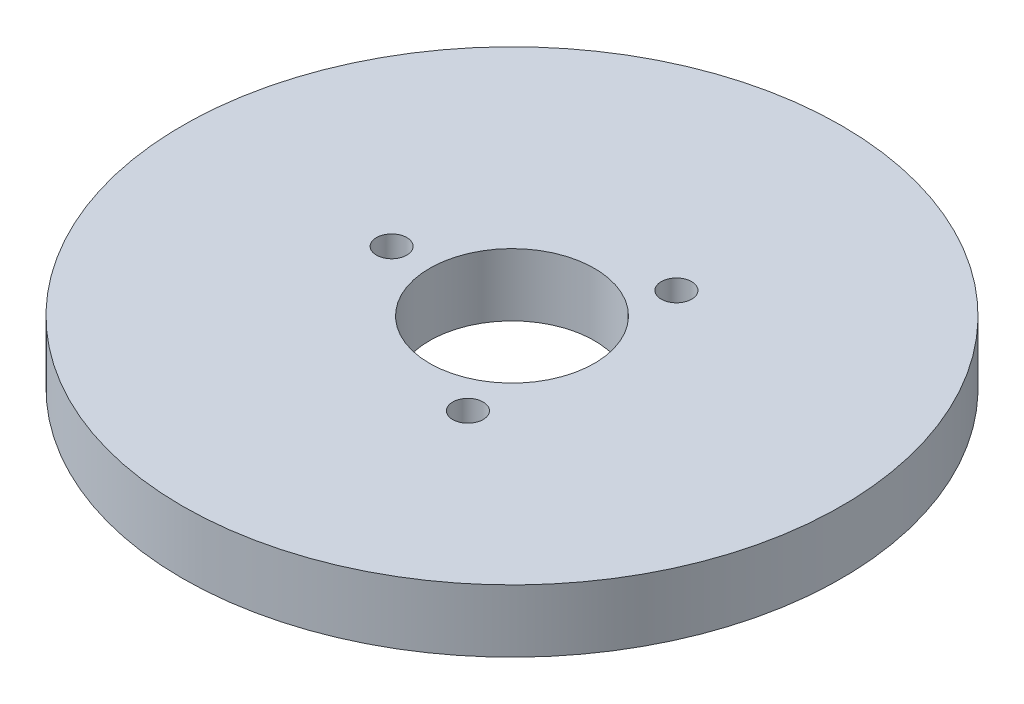
ISO-10303-21;
HEADER;
FILE_DESCRIPTION(('STEP AP214'),'2;1');
FILE_NAME('part.step','',(''),(''),'','','');
FILE_SCHEMA(('AUTOMOTIVE_DESIGN { 1 0 10303 214 1 1 1 1 }'));
ENDSEC;
DATA;
#1=APPLICATION_CONTEXT('core data for automotive mechanical design processes');
#2=APPLICATION_PROTOCOL_DEFINITION('international standard','automotive_design',2000,#1);
#3=PRODUCT_CONTEXT('',#1,'mechanical');
#4=PRODUCT('Part','Part','',(#3));
#5=PRODUCT_RELATED_PRODUCT_CATEGORY('part','',(#4));
#6=PRODUCT_DEFINITION_FORMATION('','',#4);
#7=PRODUCT_DEFINITION_CONTEXT('part definition',#1,'design');
#8=PRODUCT_DEFINITION('design','',#6,#7);
#9=PRODUCT_DEFINITION_SHAPE('','',#8);
#10=(LENGTH_UNIT() NAMED_UNIT(*) SI_UNIT(.MILLI.,.METRE.));
#11=(NAMED_UNIT(*) PLANE_ANGLE_UNIT() SI_UNIT($,.RADIAN.));
#12=(NAMED_UNIT(*) SI_UNIT($,.STERADIAN.) SOLID_ANGLE_UNIT());
#13=UNCERTAINTY_MEASURE_WITH_UNIT(LENGTH_MEASURE(1.E-05),#10,'distance_accuracy_value','');
#14=(GEOMETRIC_REPRESENTATION_CONTEXT(3) GLOBAL_UNCERTAINTY_ASSIGNED_CONTEXT((#13)) GLOBAL_UNIT_ASSIGNED_CONTEXT((#10,
#11,#12)) REPRESENTATION_CONTEXT('',''));
#15=CARTESIAN_POINT('',(0.,0.,0.));
#16=DIRECTION('',(0.,0.,1.));
#17=DIRECTION('',(1.,0.,0.));
#18=AXIS2_PLACEMENT_3D('',#15,#16,#17);
#19=CARTESIAN_POINT('',(0.,19.,0.));
#20=DIRECTION('',(0.,-1.,0.));
#21=DIRECTION('',(0.,0.,-1.));
#22=AXIS2_PLACEMENT_3D('',#19,#20,#21);
#23=CYLINDRICAL_SURFACE('',#22,100.);
#24=CARTESIAN_POINT('',(0.,19.,0.));
#25=DIRECTION('',(0.,1.,0.));
#26=DIRECTION('',(0.,0.,1.));
#27=AXIS2_PLACEMENT_3D('',#24,#25,#26);
#28=CIRCLE('',#27,100.);
#29=CARTESIAN_POINT('',(0.,19.,100.));
#30=VERTEX_POINT('',#29);
#31=EDGE_CURVE('E10',#30,#30,#28,.T.);
#32=ORIENTED_EDGE('',*,*,#31,.F.);
#33=EDGE_LOOP('',(#32));
#34=FACE_BOUND('',#33,.T.);
#35=CARTESIAN_POINT('',(0.,0.,0.));
#36=DIRECTION('',(0.,1.,0.));
#37=DIRECTION('',(0.,0.,1.));
#38=AXIS2_PLACEMENT_3D('',#35,#36,#37);
#39=CIRCLE('',#38,100.);
#40=CARTESIAN_POINT('',(0.,0.,100.));
#41=VERTEX_POINT('',#40);
#42=EDGE_CURVE('E37',#41,#41,#39,.T.);
#43=ORIENTED_EDGE('',*,*,#42,.T.);
#44=EDGE_LOOP('',(#43));
#45=FACE_BOUND('',#44,.T.);
#46=ADVANCED_FACE('F40',(#34,#45),#23,.T.);
#47=CARTESIAN_POINT('',(0.,19.,0.));
#48=DIRECTION('',(0.,1.,0.));
#49=DIRECTION('',(0.,0.,1.));
#50=AXIS2_PLACEMENT_3D('',#47,#48,#49);
#51=PLANE('',#50);
#52=CARTESIAN_POINT('',(18.2629054863627,19.,31.6322801962083));
#53=DIRECTION('',(0.,1.,0.));
#54=DIRECTION('',(0.866025403784436,0.,-0.500000000000004));
#55=AXIS2_PLACEMENT_3D('',#52,#53,#54);
#56=CIRCLE('',#55,4.62204939562099);
#57=CARTESIAN_POINT('',(22.265717680517,19.,29.3212554983978));
#58=VERTEX_POINT('',#57);
#59=EDGE_CURVE('E70',#58,#58,#56,.T.);
#60=ORIENTED_EDGE('',*,*,#59,.F.);
#61=EDGE_LOOP('',(#60));
#62=FACE_BOUND('',#61,.T.);
#63=CARTESIAN_POINT('',(18.2629054863623,19.,-31.6322801962086));
#64=DIRECTION('',(0.,1.,0.));
#65=DIRECTION('',(-0.866025403784443,0.,-0.499999999999992));
#66=AXIS2_PLACEMENT_3D('',#63,#64,#65);
#67=CIRCLE('',#66,4.62204939562099);
#68=CARTESIAN_POINT('',(14.260093292208,19.,-33.943304894019));
#69=VERTEX_POINT('',#68);
#70=EDGE_CURVE('E61',#69,#69,#67,.T.);
#71=ORIENTED_EDGE('',*,*,#70,.F.);
#72=EDGE_LOOP('',(#71));
#73=FACE_BOUND('',#72,.T.);
#74=CARTESIAN_POINT('',(-36.5258109727252,19.,0.));
#75=DIRECTION('',(0.,1.,0.));
#76=DIRECTION('',(0.,0.,1.));
#77=AXIS2_PLACEMENT_3D('',#74,#75,#76);
#78=CIRCLE('',#77,4.62204939562099);
#79=CARTESIAN_POINT('',(-36.5258109727252,19.,4.62204939562099));
#80=VERTEX_POINT('',#79);
#81=EDGE_CURVE('E54',#80,#80,#78,.T.);
#82=ORIENTED_EDGE('',*,*,#81,.F.);
#83=EDGE_LOOP('',(#82));
#84=FACE_BOUND('',#83,.T.);
#85=CARTESIAN_POINT('',(0.,19.,0.));
#86=DIRECTION('',(0.,1.,0.));
#87=DIRECTION('',(0.,0.,1.));
#88=AXIS2_PLACEMENT_3D('',#85,#86,#87);
#89=CIRCLE('',#88,25.);
#90=CARTESIAN_POINT('',(0.,19.,25.));
#91=VERTEX_POINT('',#90);
#92=EDGE_CURVE('E50',#91,#91,#89,.T.);
#93=ORIENTED_EDGE('',*,*,#92,.F.);
#94=EDGE_LOOP('',(#93));
#95=FACE_BOUND('',#94,.T.);
#96=ORIENTED_EDGE('',*,*,#31,.T.);
#97=EDGE_LOOP('',(#96));
#98=FACE_BOUND('',#97,.T.);
#99=ADVANCED_FACE('F85',(#62,#73,#84,#95,#98),#51,.T.);
#100=CARTESIAN_POINT('',(0.,0.,0.));
#101=DIRECTION('',(0.,1.,0.));
#102=DIRECTION('',(0.,0.,1.));
#103=AXIS2_PLACEMENT_3D('',#100,#101,#102);
#104=PLANE('',#103);
#105=CARTESIAN_POINT('',(0.,0.,0.));
#106=DIRECTION('',(0.,1.,0.));
#107=DIRECTION('',(0.,0.,1.));
#108=AXIS2_PLACEMENT_3D('',#105,#106,#107);
#109=CIRCLE('',#108,25.);
#110=CARTESIAN_POINT('',(0.,0.,25.));
#111=VERTEX_POINT('',#110);
#112=EDGE_CURVE('E47',#111,#111,#109,.T.);
#113=ORIENTED_EDGE('',*,*,#112,.T.);
#114=EDGE_LOOP('',(#113));
#115=FACE_BOUND('',#114,.T.);
#116=ORIENTED_EDGE('',*,*,#42,.F.);
#117=EDGE_LOOP('',(#116));
#118=FACE_BOUND('',#117,.T.);
#119=ADVANCED_FACE('F84',(#115,#118),#104,.F.);
#120=CARTESIAN_POINT('',(0.,19.,0.));
#121=DIRECTION('',(0.,-1.,0.));
#122=DIRECTION('',(0.,0.,-1.));
#123=AXIS2_PLACEMENT_3D('',#120,#121,#122);
#124=CYLINDRICAL_SURFACE('',#123,25.);
#125=ORIENTED_EDGE('',*,*,#92,.T.);
#126=EDGE_LOOP('',(#125));
#127=FACE_BOUND('',#126,.T.);
#128=ORIENTED_EDGE('',*,*,#112,.F.);
#129=EDGE_LOOP('',(#128));
#130=FACE_BOUND('',#129,.T.);
#131=ADVANCED_FACE('F91',(#127,#130),#124,.F.);
#132=CARTESIAN_POINT('',(-36.5258109727252,6.33982499977909,0.));
#133=DIRECTION('',(0.,1.,0.));
#134=DIRECTION('',(0.,0.,1.));
#135=AXIS2_PLACEMENT_3D('',#132,#133,#134);
#136=CYLINDRICAL_SURFACE('',#135,4.62204939562099);
#137=CARTESIAN_POINT('',(-36.5258109727252,6.33982499977909,0.));
#138=DIRECTION('',(0.,1.,0.));
#139=DIRECTION('',(0.,0.,1.));
#140=AXIS2_PLACEMENT_3D('',#137,#138,#139);
#141=CIRCLE('',#140,4.62204939562099);
#142=CARTESIAN_POINT('',(-36.5258109727252,6.33982499977909,4.62204939562099));
#143=VERTEX_POINT('',#142);
#144=EDGE_CURVE('E55',#143,#143,#141,.T.);
#145=ORIENTED_EDGE('',*,*,#144,.F.);
#146=EDGE_LOOP('',(#145));
#147=FACE_BOUND('',#146,.T.);
#148=ORIENTED_EDGE('',*,*,#81,.T.);
#149=EDGE_LOOP('',(#148));
#150=FACE_BOUND('',#149,.T.);
#151=ADVANCED_FACE('F96',(#147,#150),#136,.F.);
#152=CARTESIAN_POINT('',(-36.5258109727252,6.33982499977909,0.));
#153=DIRECTION('',(0.,1.,0.));
#154=DIRECTION('',(0.,0.,1.));
#155=AXIS2_PLACEMENT_3D('',#152,#153,#154);
#156=PLANE('',#155);
#157=ORIENTED_EDGE('',*,*,#144,.T.);
#158=EDGE_LOOP('',(#157));
#159=FACE_BOUND('',#158,.T.);
#160=ADVANCED_FACE('F127',(#159),#156,.T.);
#161=CARTESIAN_POINT('',(18.2629054863623,6.33982499977909,-31.6322801962086));
#162=DIRECTION('',(0.,1.,0.));
#163=DIRECTION('',(0.,0.,1.));
#164=AXIS2_PLACEMENT_3D('',#161,#162,#163);
#165=CYLINDRICAL_SURFACE('',#164,4.62204939562099);
#166=CARTESIAN_POINT('',(18.2629054863623,6.33982499977909,-31.6322801962086));
#167=DIRECTION('',(0.,1.,0.));
#168=DIRECTION('',(-0.866025403784443,0.,-0.499999999999992));
#169=AXIS2_PLACEMENT_3D('',#166,#167,#168);
#170=CIRCLE('',#169,4.62204939562099);
#171=CARTESIAN_POINT('',(14.260093292208,6.33982499977909,-33.943304894019));
#172=VERTEX_POINT('',#171);
#173=EDGE_CURVE('E63',#172,#172,#170,.T.);
#174=ORIENTED_EDGE('',*,*,#173,.F.);
#175=EDGE_LOOP('',(#174));
#176=FACE_BOUND('',#175,.T.);
#177=ORIENTED_EDGE('',*,*,#70,.T.);
#178=EDGE_LOOP('',(#177));
#179=FACE_BOUND('',#178,.T.);
#180=ADVANCED_FACE('F133',(#176,#179),#165,.F.);
#181=CARTESIAN_POINT('',(18.2629054863623,6.33982499977909,-31.6322801962086));
#182=DIRECTION('',(0.,1.,0.));
#183=DIRECTION('',(-0.866025403784443,0.,-0.499999999999992));
#184=AXIS2_PLACEMENT_3D('',#181,#182,#183);
#185=PLANE('',#184);
#186=ORIENTED_EDGE('',*,*,#173,.T.);
#187=EDGE_LOOP('',(#186));
#188=FACE_BOUND('',#187,.T.);
#189=ADVANCED_FACE('F77',(#188),#185,.T.);
#190=CARTESIAN_POINT('',(18.2629054863627,6.33982499977909,31.6322801962083));
#191=DIRECTION('',(0.,1.,0.));
#192=DIRECTION('',(0.,0.,1.));
#193=AXIS2_PLACEMENT_3D('',#190,#191,#192);
#194=CYLINDRICAL_SURFACE('',#193,4.62204939562099);
#195=CARTESIAN_POINT('',(18.2629054863627,6.33982499977909,31.6322801962083));
#196=DIRECTION('',(0.,1.,0.));
#197=DIRECTION('',(0.866025403784436,0.,-0.500000000000004));
#198=AXIS2_PLACEMENT_3D('',#195,#196,#197);
#199=CIRCLE('',#198,4.62204939562099);
#200=CARTESIAN_POINT('',(22.265717680517,6.33982499977909,29.3212554983978));
#201=VERTEX_POINT('',#200);
#202=EDGE_CURVE('E59',#201,#201,#199,.T.);
#203=ORIENTED_EDGE('',*,*,#202,.F.);
#204=EDGE_LOOP('',(#203));
#205=FACE_BOUND('',#204,.T.);
#206=ORIENTED_EDGE('',*,*,#59,.T.);
#207=EDGE_LOOP('',(#206));
#208=FACE_BOUND('',#207,.T.);
#209=ADVANCED_FACE('F73',(#205,#208),#194,.F.);
#210=CARTESIAN_POINT('',(18.2629054863627,6.33982499977909,31.6322801962083));
#211=DIRECTION('',(0.,1.,0.));
#212=DIRECTION('',(0.866025403784436,0.,-0.500000000000004));
#213=AXIS2_PLACEMENT_3D('',#210,#211,#212);
#214=PLANE('',#213);
#215=ORIENTED_EDGE('',*,*,#202,.T.);
#216=EDGE_LOOP('',(#215));
#217=FACE_BOUND('',#216,.T.);
#218=ADVANCED_FACE('F71',(#217),#214,.T.);
#219=CLOSED_SHELL('',(#46,#99,#119,#131,#151,#160,#180,#189,#209,#218));
#220=MANIFOLD_SOLID_BREP('B2',#219);
#221=ADVANCED_BREP_SHAPE_REPRESENTATION('',(#18,#220),#14);
#222=SHAPE_DEFINITION_REPRESENTATION(#9,#221);
ENDSEC;
END-ISO-10303-21;
